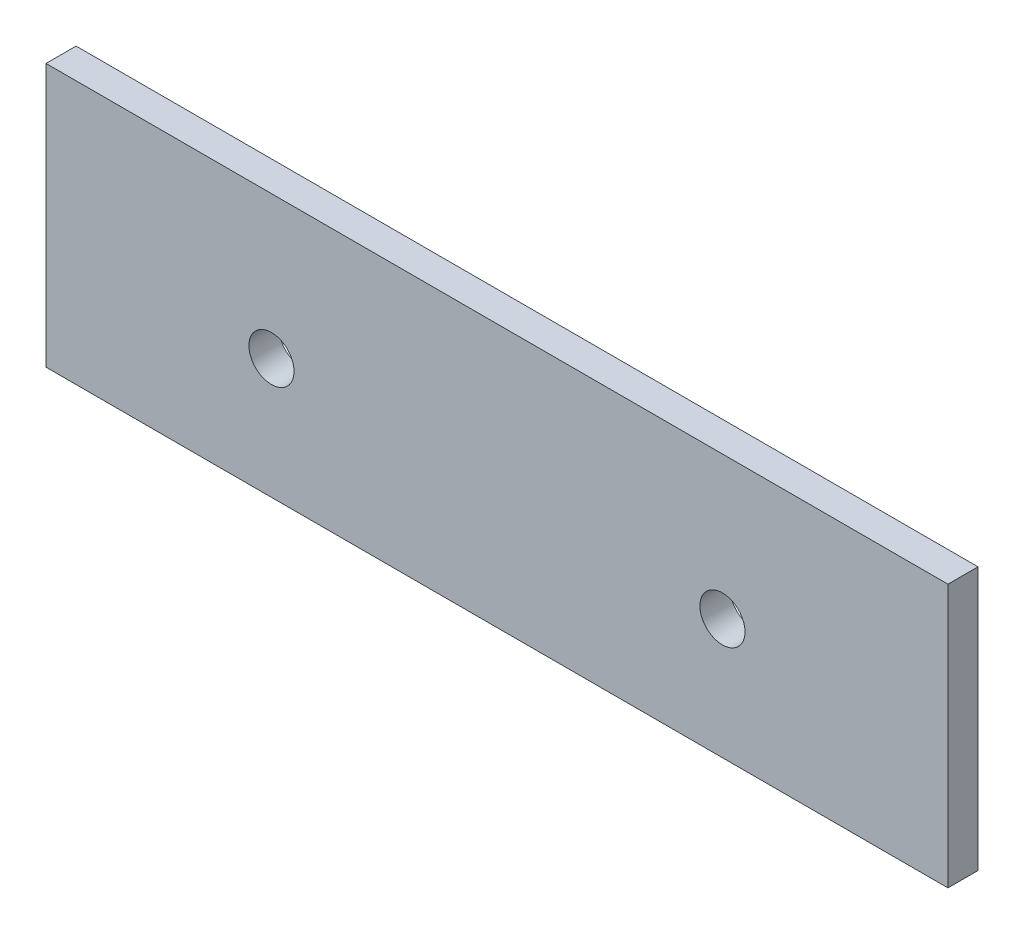
ISO-10303-21;
HEADER;
FILE_DESCRIPTION(('STEP AP214'),'2;1');
FILE_NAME('part.step','',(''),(''),'','','');
FILE_SCHEMA(('AUTOMOTIVE_DESIGN { 1 0 10303 214 1 1 1 1 }'));
ENDSEC;
DATA;
#1=APPLICATION_CONTEXT('core data for automotive mechanical design processes');
#2=APPLICATION_PROTOCOL_DEFINITION('international standard','automotive_design',2000,#1);
#3=PRODUCT_CONTEXT('',#1,'mechanical');
#4=PRODUCT('Part','Part','',(#3));
#5=PRODUCT_RELATED_PRODUCT_CATEGORY('part','',(#4));
#6=PRODUCT_DEFINITION_FORMATION('','',#4);
#7=PRODUCT_DEFINITION_CONTEXT('part definition',#1,'design');
#8=PRODUCT_DEFINITION('design','',#6,#7);
#9=PRODUCT_DEFINITION_SHAPE('','',#8);
#10=(LENGTH_UNIT() NAMED_UNIT(*) SI_UNIT(.MILLI.,.METRE.));
#11=(NAMED_UNIT(*) PLANE_ANGLE_UNIT() SI_UNIT($,.RADIAN.));
#12=(NAMED_UNIT(*) SI_UNIT($,.STERADIAN.) SOLID_ANGLE_UNIT());
#13=UNCERTAINTY_MEASURE_WITH_UNIT(LENGTH_MEASURE(1.E-05),#10,'distance_accuracy_value','');
#14=(GEOMETRIC_REPRESENTATION_CONTEXT(3) GLOBAL_UNCERTAINTY_ASSIGNED_CONTEXT((#13)) GLOBAL_UNIT_ASSIGNED_CONTEXT((#10,
#11,#12)) REPRESENTATION_CONTEXT('',''));
#15=CARTESIAN_POINT('',(0.,0.,0.));
#16=DIRECTION('',(0.,0.,1.));
#17=DIRECTION('',(1.,0.,0.));
#18=AXIS2_PLACEMENT_3D('',#15,#16,#17);
#19=CARTESIAN_POINT('',(30.,-8.75,2.));
#20=DIRECTION('',(-1.,0.,0.));
#21=DIRECTION('',(0.,0.,1.));
#22=AXIS2_PLACEMENT_3D('',#19,#20,#21);
#23=PLANE('',#22);
#24=DIRECTION('',(0.,1.,0.));
#25=VECTOR('',#24,1.);
#26=CARTESIAN_POINT('',(30.,-8.75,0.));
#27=LINE('',#26,#25);
#28=CARTESIAN_POINT('',(30.,-8.75,0.));
#29=VERTEX_POINT('',#28);
#30=CARTESIAN_POINT('',(30.,8.75,0.));
#31=VERTEX_POINT('',#30);
#32=EDGE_CURVE('E95',#29,#31,#27,.T.);
#33=ORIENTED_EDGE('',*,*,#32,.T.);
#34=DIRECTION('',(0.,0.,-1.));
#35=VECTOR('',#34,1.);
#36=CARTESIAN_POINT('',(30.,8.75,2.));
#37=LINE('',#36,#35);
#38=CARTESIAN_POINT('',(30.,8.75,2.));
#39=VERTEX_POINT('',#38);
#40=EDGE_CURVE('E11',#39,#31,#37,.T.);
#41=ORIENTED_EDGE('',*,*,#40,.F.);
#42=DIRECTION('',(0.,1.,0.));
#43=VECTOR('',#42,1.);
#44=CARTESIAN_POINT('',(30.,-8.75,2.));
#45=LINE('',#44,#43);
#46=CARTESIAN_POINT('',(30.,-8.75,2.));
#47=VERTEX_POINT('',#46);
#48=EDGE_CURVE('E83',#47,#39,#45,.T.);
#49=ORIENTED_EDGE('',*,*,#48,.F.);
#50=DIRECTION('',(0.,0.,-1.));
#51=VECTOR('',#50,1.);
#52=CARTESIAN_POINT('',(30.,-8.75,2.));
#53=LINE('',#52,#51);
#54=EDGE_CURVE('E91',#47,#29,#53,.T.);
#55=ORIENTED_EDGE('',*,*,#54,.T.);
#56=EDGE_LOOP('',(#33,#41,#49,#55));
#57=FACE_BOUND('',#56,.T.);
#58=ADVANCED_FACE('F32',(#57),#23,.F.);
#59=CARTESIAN_POINT('',(-30.,8.75,2.));
#60=DIRECTION('',(0.,-1.,0.));
#61=DIRECTION('',(0.,0.,-1.));
#62=AXIS2_PLACEMENT_3D('',#59,#60,#61);
#63=PLANE('',#62);
#64=DIRECTION('',(-1.,0.,0.));
#65=VECTOR('',#64,1.);
#66=CARTESIAN_POINT('',(-30.,8.75,0.));
#67=LINE('',#66,#65);
#68=CARTESIAN_POINT('',(-30.,8.75,0.));
#69=VERTEX_POINT('',#68);
#70=EDGE_CURVE('E87',#31,#69,#67,.T.);
#71=ORIENTED_EDGE('',*,*,#70,.T.);
#72=DIRECTION('',(0.,0.,-1.));
#73=VECTOR('',#72,1.);
#74=CARTESIAN_POINT('',(-30.,8.75,2.));
#75=LINE('',#74,#73);
#76=CARTESIAN_POINT('',(-30.,8.75,2.));
#77=VERTEX_POINT('',#76);
#78=EDGE_CURVE('E40',#77,#69,#75,.T.);
#79=ORIENTED_EDGE('',*,*,#78,.F.);
#80=DIRECTION('',(-1.,0.,0.));
#81=VECTOR('',#80,1.);
#82=CARTESIAN_POINT('',(-30.,8.75,2.));
#83=LINE('',#82,#81);
#84=EDGE_CURVE('E78',#39,#77,#83,.T.);
#85=ORIENTED_EDGE('',*,*,#84,.F.);
#86=ORIENTED_EDGE('',*,*,#40,.T.);
#87=EDGE_LOOP('',(#71,#79,#85,#86));
#88=FACE_BOUND('',#87,.T.);
#89=ADVANCED_FACE('F86',(#88),#63,.F.);
#90=CARTESIAN_POINT('',(-30.,-8.75,2.));
#91=DIRECTION('',(1.,0.,0.));
#92=DIRECTION('',(0.,0.,-1.));
#93=AXIS2_PLACEMENT_3D('',#90,#91,#92);
#94=PLANE('',#93);
#95=DIRECTION('',(0.,-1.,0.));
#96=VECTOR('',#95,1.);
#97=CARTESIAN_POINT('',(-30.,-8.75,0.));
#98=LINE('',#97,#96);
#99=CARTESIAN_POINT('',(-30.,-8.75,0.));
#100=VERTEX_POINT('',#99);
#101=EDGE_CURVE('E65',#69,#100,#98,.T.);
#102=ORIENTED_EDGE('',*,*,#101,.T.);
#103=DIRECTION('',(0.,0.,-1.));
#104=VECTOR('',#103,1.);
#105=CARTESIAN_POINT('',(-30.,-8.75,2.));
#106=LINE('',#105,#104);
#107=CARTESIAN_POINT('',(-30.,-8.75,2.));
#108=VERTEX_POINT('',#107);
#109=EDGE_CURVE('E88',#108,#100,#106,.T.);
#110=ORIENTED_EDGE('',*,*,#109,.F.);
#111=DIRECTION('',(0.,-1.,0.));
#112=VECTOR('',#111,1.);
#113=CARTESIAN_POINT('',(-30.,-8.75,2.));
#114=LINE('',#113,#112);
#115=EDGE_CURVE('E81',#77,#108,#114,.T.);
#116=ORIENTED_EDGE('',*,*,#115,.F.);
#117=ORIENTED_EDGE('',*,*,#78,.T.);
#118=EDGE_LOOP('',(#102,#110,#116,#117));
#119=FACE_BOUND('',#118,.T.);
#120=ADVANCED_FACE('F89',(#119),#94,.F.);
#121=CARTESIAN_POINT('',(-30.,-8.75,2.));
#122=DIRECTION('',(0.,1.,0.));
#123=DIRECTION('',(0.,0.,1.));
#124=AXIS2_PLACEMENT_3D('',#121,#122,#123);
#125=PLANE('',#124);
#126=DIRECTION('',(1.,0.,0.));
#127=VECTOR('',#126,1.);
#128=CARTESIAN_POINT('',(-30.,-8.75,0.));
#129=LINE('',#128,#127);
#130=EDGE_CURVE('E71',#100,#29,#129,.T.);
#131=ORIENTED_EDGE('',*,*,#130,.T.);
#132=ORIENTED_EDGE('',*,*,#54,.F.);
#133=DIRECTION('',(1.,0.,0.));
#134=VECTOR('',#133,1.);
#135=CARTESIAN_POINT('',(-30.,-8.75,2.));
#136=LINE('',#135,#134);
#137=EDGE_CURVE('E48',#108,#47,#136,.T.);
#138=ORIENTED_EDGE('',*,*,#137,.F.);
#139=ORIENTED_EDGE('',*,*,#109,.T.);
#140=EDGE_LOOP('',(#131,#132,#138,#139));
#141=FACE_BOUND('',#140,.T.);
#142=ADVANCED_FACE('F103',(#141),#125,.F.);
#143=CARTESIAN_POINT('',(0.,0.,2.));
#144=DIRECTION('',(0.,0.,-1.));
#145=DIRECTION('',(-1.,0.,0.));
#146=AXIS2_PLACEMENT_3D('',#143,#144,#145);
#147=PLANE('',#146);
#148=CARTESIAN_POINT('',(15.,-0.749999999999999,2.));
#149=DIRECTION('',(0.,0.,-1.));
#150=DIRECTION('',(-1.,0.,0.));
#151=AXIS2_PLACEMENT_3D('',#148,#149,#150);
#152=CIRCLE('',#151,1.5);
#153=CARTESIAN_POINT('',(13.5,-0.749999999999999,2.));
#154=VERTEX_POINT('',#153);
#155=EDGE_CURVE('E112',#154,#154,#152,.T.);
#156=ORIENTED_EDGE('',*,*,#155,.T.);
#157=EDGE_LOOP('',(#156));
#158=FACE_BOUND('',#157,.T.);
#159=CARTESIAN_POINT('',(-15.,-0.749999999999999,2.));
#160=DIRECTION('',(0.,0.,-1.));
#161=DIRECTION('',(-1.,0.,0.));
#162=AXIS2_PLACEMENT_3D('',#159,#160,#161);
#163=CIRCLE('',#162,1.5);
#164=CARTESIAN_POINT('',(-16.5,-0.749999999999999,2.));
#165=VERTEX_POINT('',#164);
#166=EDGE_CURVE('E98',#165,#165,#163,.T.);
#167=ORIENTED_EDGE('',*,*,#166,.T.);
#168=EDGE_LOOP('',(#167));
#169=FACE_BOUND('',#168,.T.);
#170=ORIENTED_EDGE('',*,*,#48,.T.);
#171=ORIENTED_EDGE('',*,*,#84,.T.);
#172=ORIENTED_EDGE('',*,*,#115,.T.);
#173=ORIENTED_EDGE('',*,*,#137,.T.);
#174=EDGE_LOOP('',(#170,#171,#172,#173));
#175=FACE_BOUND('',#174,.T.);
#176=ADVANCED_FACE('F79',(#158,#169,#175),#147,.F.);
#177=CARTESIAN_POINT('',(0.,0.,0.));
#178=DIRECTION('',(0.,0.,-1.));
#179=DIRECTION('',(-1.,0.,0.));
#180=AXIS2_PLACEMENT_3D('',#177,#178,#179);
#181=PLANE('',#180);
#182=CARTESIAN_POINT('',(15.,-0.749999999999999,0.));
#183=DIRECTION('',(0.,0.,-1.));
#184=DIRECTION('',(-1.,0.,0.));
#185=AXIS2_PLACEMENT_3D('',#182,#183,#184);
#186=CIRCLE('',#185,1.5);
#187=CARTESIAN_POINT('',(13.5,-0.749999999999999,0.));
#188=VERTEX_POINT('',#187);
#189=EDGE_CURVE('E115',#188,#188,#186,.T.);
#190=ORIENTED_EDGE('',*,*,#189,.F.);
#191=EDGE_LOOP('',(#190));
#192=FACE_BOUND('',#191,.T.);
#193=CARTESIAN_POINT('',(-15.,-0.749999999999999,0.));
#194=DIRECTION('',(0.,0.,-1.));
#195=DIRECTION('',(-1.,0.,0.));
#196=AXIS2_PLACEMENT_3D('',#193,#194,#195);
#197=CIRCLE('',#196,1.5);
#198=CARTESIAN_POINT('',(-16.5,-0.749999999999999,0.));
#199=VERTEX_POINT('',#198);
#200=EDGE_CURVE('E109',#199,#199,#197,.T.);
#201=ORIENTED_EDGE('',*,*,#200,.F.);
#202=EDGE_LOOP('',(#201));
#203=FACE_BOUND('',#202,.T.);
#204=ORIENTED_EDGE('',*,*,#32,.F.);
#205=ORIENTED_EDGE('',*,*,#130,.F.);
#206=ORIENTED_EDGE('',*,*,#101,.F.);
#207=ORIENTED_EDGE('',*,*,#70,.F.);
#208=EDGE_LOOP('',(#204,#205,#206,#207));
#209=FACE_BOUND('',#208,.T.);
#210=ADVANCED_FACE('F106',(#192,#203,#209),#181,.T.);
#211=CARTESIAN_POINT('',(-15.,-0.749999999999999,2.));
#212=DIRECTION('',(0.,0.,-1.));
#213=DIRECTION('',(-1.,0.,0.));
#214=AXIS2_PLACEMENT_3D('',#211,#212,#213);
#215=CYLINDRICAL_SURFACE('',#214,1.5);
#216=ORIENTED_EDGE('',*,*,#166,.F.);
#217=EDGE_LOOP('',(#216));
#218=FACE_BOUND('',#217,.T.);
#219=ORIENTED_EDGE('',*,*,#200,.T.);
#220=EDGE_LOOP('',(#219));
#221=FACE_BOUND('',#220,.T.);
#222=ADVANCED_FACE('F126',(#218,#221),#215,.F.);
#223=CARTESIAN_POINT('',(15.,-0.749999999999999,2.));
#224=DIRECTION('',(0.,0.,-1.));
#225=DIRECTION('',(-1.,0.,0.));
#226=AXIS2_PLACEMENT_3D('',#223,#224,#225);
#227=CYLINDRICAL_SURFACE('',#226,1.5);
#228=ORIENTED_EDGE('',*,*,#155,.F.);
#229=EDGE_LOOP('',(#228));
#230=FACE_BOUND('',#229,.T.);
#231=ORIENTED_EDGE('',*,*,#189,.T.);
#232=EDGE_LOOP('',(#231));
#233=FACE_BOUND('',#232,.T.);
#234=ADVANCED_FACE('F123',(#230,#233),#227,.F.);
#235=CLOSED_SHELL('',(#58,#89,#120,#142,#176,#210,#222,#234));
#236=MANIFOLD_SOLID_BREP('B2',#235);
#237=ADVANCED_BREP_SHAPE_REPRESENTATION('',(#18,#236),#14);
#238=SHAPE_DEFINITION_REPRESENTATION(#9,#237);
ENDSEC;
END-ISO-10303-21;
